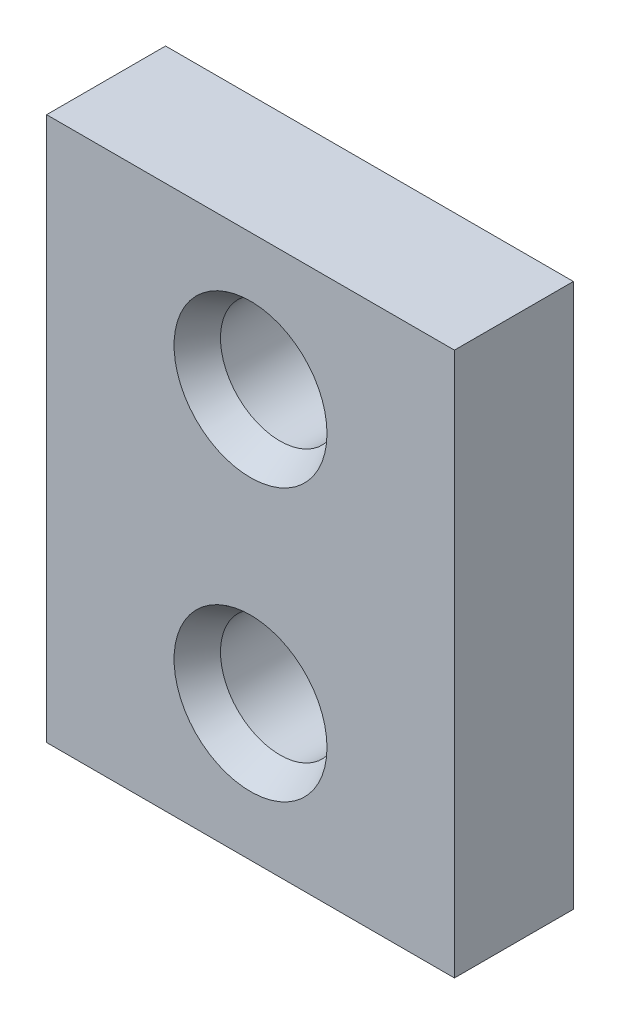
ISO-10303-21;
HEADER;
FILE_DESCRIPTION(('STEP AP214'),'2;1');
FILE_NAME('part.step','',(''),(''),'','','');
FILE_SCHEMA(('AUTOMOTIVE_DESIGN { 1 0 10303 214 1 1 1 1 }'));
ENDSEC;
DATA;
#1=APPLICATION_CONTEXT('core data for automotive mechanical design processes');
#2=APPLICATION_PROTOCOL_DEFINITION('international standard','automotive_design',2000,#1);
#3=PRODUCT_CONTEXT('',#1,'mechanical');
#4=PRODUCT('Part','Part','',(#3));
#5=PRODUCT_RELATED_PRODUCT_CATEGORY('part','',(#4));
#6=PRODUCT_DEFINITION_FORMATION('','',#4);
#7=PRODUCT_DEFINITION_CONTEXT('part definition',#1,'design');
#8=PRODUCT_DEFINITION('design','',#6,#7);
#9=PRODUCT_DEFINITION_SHAPE('','',#8);
#10=(LENGTH_UNIT() NAMED_UNIT(*) SI_UNIT(.MILLI.,.METRE.));
#11=(NAMED_UNIT(*) PLANE_ANGLE_UNIT() SI_UNIT($,.RADIAN.));
#12=(NAMED_UNIT(*) SI_UNIT($,.STERADIAN.) SOLID_ANGLE_UNIT());
#13=UNCERTAINTY_MEASURE_WITH_UNIT(LENGTH_MEASURE(1.E-05),#10,'distance_accuracy_value','');
#14=(GEOMETRIC_REPRESENTATION_CONTEXT(3) GLOBAL_UNCERTAINTY_ASSIGNED_CONTEXT((#13)) GLOBAL_UNIT_ASSIGNED_CONTEXT((#10,
#11,#12)) REPRESENTATION_CONTEXT('',''));
#15=CARTESIAN_POINT('',(0.,0.,0.));
#16=DIRECTION('',(0.,0.,1.));
#17=DIRECTION('',(1.,0.,0.));
#18=AXIS2_PLACEMENT_3D('',#15,#16,#17);
#19=CARTESIAN_POINT('',(12.,-16.,3.5));
#20=DIRECTION('',(-1.,0.,0.));
#21=DIRECTION('',(0.,0.,1.));
#22=AXIS2_PLACEMENT_3D('',#19,#20,#21);
#23=PLANE('',#22);
#24=DIRECTION('',(0.,1.,0.));
#25=VECTOR('',#24,1.);
#26=CARTESIAN_POINT('',(12.,-16.,-3.5));
#27=LINE('',#26,#25);
#28=CARTESIAN_POINT('',(12.,-16.,-3.5));
#29=VERTEX_POINT('',#28);
#30=CARTESIAN_POINT('',(12.,16.,-3.5));
#31=VERTEX_POINT('',#30);
#32=EDGE_CURVE('E99',#29,#31,#27,.T.);
#33=ORIENTED_EDGE('',*,*,#32,.T.);
#34=DIRECTION('',(0.,0.,-1.));
#35=VECTOR('',#34,1.);
#36=CARTESIAN_POINT('',(12.,16.,3.5));
#37=LINE('',#36,#35);
#38=CARTESIAN_POINT('',(12.,16.,3.5));
#39=VERTEX_POINT('',#38);
#40=EDGE_CURVE('E11',#39,#31,#37,.T.);
#41=ORIENTED_EDGE('',*,*,#40,.F.);
#42=DIRECTION('',(0.,1.,0.));
#43=VECTOR('',#42,1.);
#44=CARTESIAN_POINT('',(12.,-16.,3.5));
#45=LINE('',#44,#43);
#46=CARTESIAN_POINT('',(12.,-16.,3.5));
#47=VERTEX_POINT('',#46);
#48=EDGE_CURVE('E86',#47,#39,#45,.T.);
#49=ORIENTED_EDGE('',*,*,#48,.F.);
#50=DIRECTION('',(0.,0.,-1.));
#51=VECTOR('',#50,1.);
#52=CARTESIAN_POINT('',(12.,-16.,3.5));
#53=LINE('',#52,#51);
#54=EDGE_CURVE('E95',#47,#29,#53,.T.);
#55=ORIENTED_EDGE('',*,*,#54,.T.);
#56=EDGE_LOOP('',(#33,#41,#49,#55));
#57=FACE_BOUND('',#56,.T.);
#58=ADVANCED_FACE('F33',(#57),#23,.F.);
#59=CARTESIAN_POINT('',(-12.,16.,3.5));
#60=DIRECTION('',(0.,-1.,0.));
#61=DIRECTION('',(0.,0.,-1.));
#62=AXIS2_PLACEMENT_3D('',#59,#60,#61);
#63=PLANE('',#62);
#64=DIRECTION('',(-1.,0.,0.));
#65=VECTOR('',#64,1.);
#66=CARTESIAN_POINT('',(-12.,16.,-3.5));
#67=LINE('',#66,#65);
#68=CARTESIAN_POINT('',(-12.,16.,-3.5));
#69=VERTEX_POINT('',#68);
#70=EDGE_CURVE('E90',#31,#69,#67,.T.);
#71=ORIENTED_EDGE('',*,*,#70,.T.);
#72=DIRECTION('',(0.,0.,-1.));
#73=VECTOR('',#72,1.);
#74=CARTESIAN_POINT('',(-12.,16.,3.5));
#75=LINE('',#74,#73);
#76=CARTESIAN_POINT('',(-12.,16.,3.5));
#77=VERTEX_POINT('',#76);
#78=EDGE_CURVE('E42',#77,#69,#75,.T.);
#79=ORIENTED_EDGE('',*,*,#78,.F.);
#80=DIRECTION('',(-1.,0.,0.));
#81=VECTOR('',#80,1.);
#82=CARTESIAN_POINT('',(-12.,16.,3.5));
#83=LINE('',#82,#81);
#84=EDGE_CURVE('E81',#39,#77,#83,.T.);
#85=ORIENTED_EDGE('',*,*,#84,.F.);
#86=ORIENTED_EDGE('',*,*,#40,.T.);
#87=EDGE_LOOP('',(#71,#79,#85,#86));
#88=FACE_BOUND('',#87,.T.);
#89=ADVANCED_FACE('F89',(#88),#63,.F.);
#90=CARTESIAN_POINT('',(-12.,-16.,3.5));
#91=DIRECTION('',(1.,0.,0.));
#92=DIRECTION('',(0.,0.,-1.));
#93=AXIS2_PLACEMENT_3D('',#90,#91,#92);
#94=PLANE('',#93);
#95=DIRECTION('',(0.,-1.,0.));
#96=VECTOR('',#95,1.);
#97=CARTESIAN_POINT('',(-12.,-16.,-3.5));
#98=LINE('',#97,#96);
#99=CARTESIAN_POINT('',(-12.,-16.,-3.5));
#100=VERTEX_POINT('',#99);
#101=EDGE_CURVE('E68',#69,#100,#98,.T.);
#102=ORIENTED_EDGE('',*,*,#101,.T.);
#103=DIRECTION('',(0.,0.,-1.));
#104=VECTOR('',#103,1.);
#105=CARTESIAN_POINT('',(-12.,-16.,3.5));
#106=LINE('',#105,#104);
#107=CARTESIAN_POINT('',(-12.,-16.,3.5));
#108=VERTEX_POINT('',#107);
#109=EDGE_CURVE('E91',#108,#100,#106,.T.);
#110=ORIENTED_EDGE('',*,*,#109,.F.);
#111=DIRECTION('',(0.,-1.,0.));
#112=VECTOR('',#111,1.);
#113=CARTESIAN_POINT('',(-12.,-16.,3.5));
#114=LINE('',#113,#112);
#115=EDGE_CURVE('E84',#77,#108,#114,.T.);
#116=ORIENTED_EDGE('',*,*,#115,.F.);
#117=ORIENTED_EDGE('',*,*,#78,.T.);
#118=EDGE_LOOP('',(#102,#110,#116,#117));
#119=FACE_BOUND('',#118,.T.);
#120=ADVANCED_FACE('F93',(#119),#94,.F.);
#121=CARTESIAN_POINT('',(-12.,-16.,3.5));
#122=DIRECTION('',(0.,1.,0.));
#123=DIRECTION('',(0.,0.,1.));
#124=AXIS2_PLACEMENT_3D('',#121,#122,#123);
#125=PLANE('',#124);
#126=DIRECTION('',(1.,0.,0.));
#127=VECTOR('',#126,1.);
#128=CARTESIAN_POINT('',(-12.,-16.,-3.5));
#129=LINE('',#128,#127);
#130=EDGE_CURVE('E74',#100,#29,#129,.T.);
#131=ORIENTED_EDGE('',*,*,#130,.T.);
#132=ORIENTED_EDGE('',*,*,#54,.F.);
#133=DIRECTION('',(1.,0.,0.));
#134=VECTOR('',#133,1.);
#135=CARTESIAN_POINT('',(-12.,-16.,3.5));
#136=LINE('',#135,#134);
#137=EDGE_CURVE('E51',#108,#47,#136,.T.);
#138=ORIENTED_EDGE('',*,*,#137,.F.);
#139=ORIENTED_EDGE('',*,*,#109,.T.);
#140=EDGE_LOOP('',(#131,#132,#138,#139));
#141=FACE_BOUND('',#140,.T.);
#142=ADVANCED_FACE('F131',(#141),#125,.F.);
#143=CARTESIAN_POINT('',(0.,0.,3.5));
#144=DIRECTION('',(0.,0.,-1.));
#145=DIRECTION('',(-1.,0.,0.));
#146=AXIS2_PLACEMENT_3D('',#143,#144,#145);
#147=PLANE('',#146);
#148=CARTESIAN_POINT('',(0.,8.,3.5));
#149=DIRECTION('',(0.,0.,1.));
#150=DIRECTION('',(1.,0.,0.));
#151=AXIS2_PLACEMENT_3D('',#148,#149,#150);
#152=CIRCLE('',#151,4.5);
#153=CARTESIAN_POINT('',(4.5,8.,3.5));
#154=VERTEX_POINT('',#153);
#155=EDGE_CURVE('E122',#154,#154,#152,.T.);
#156=ORIENTED_EDGE('',*,*,#155,.F.);
#157=EDGE_LOOP('',(#156));
#158=FACE_BOUND('',#157,.T.);
#159=CARTESIAN_POINT('',(0.,-8.,3.5));
#160=DIRECTION('',(0.,0.,1.));
#161=DIRECTION('',(1.,0.,0.));
#162=AXIS2_PLACEMENT_3D('',#159,#160,#161);
#163=CIRCLE('',#162,4.5);
#164=CARTESIAN_POINT('',(4.5,-8.,3.5));
#165=VERTEX_POINT('',#164);
#166=EDGE_CURVE('E112',#165,#165,#163,.T.);
#167=ORIENTED_EDGE('',*,*,#166,.F.);
#168=EDGE_LOOP('',(#167));
#169=FACE_BOUND('',#168,.T.);
#170=ORIENTED_EDGE('',*,*,#48,.T.);
#171=ORIENTED_EDGE('',*,*,#84,.T.);
#172=ORIENTED_EDGE('',*,*,#115,.T.);
#173=ORIENTED_EDGE('',*,*,#137,.T.);
#174=EDGE_LOOP('',(#170,#171,#172,#173));
#175=FACE_BOUND('',#174,.T.);
#176=ADVANCED_FACE('F82',(#158,#169,#175),#147,.F.);
#177=CARTESIAN_POINT('',(0.,0.,-3.5));
#178=DIRECTION('',(0.,0.,-1.));
#179=DIRECTION('',(-1.,0.,0.));
#180=AXIS2_PLACEMENT_3D('',#177,#178,#179);
#181=PLANE('',#180);
#182=CARTESIAN_POINT('',(0.,8.,-3.5));
#183=DIRECTION('',(0.,0.,-1.));
#184=DIRECTION('',(-1.,0.,0.));
#185=AXIS2_PLACEMENT_3D('',#182,#183,#184);
#186=CIRCLE('',#185,3.5);
#187=CARTESIAN_POINT('',(-3.5,8.,-3.5));
#188=VERTEX_POINT('',#187);
#189=EDGE_CURVE('E36',#188,#188,#186,.T.);
#190=ORIENTED_EDGE('',*,*,#189,.F.);
#191=EDGE_LOOP('',(#190));
#192=FACE_BOUND('',#191,.T.);
#193=CARTESIAN_POINT('',(0.,-8.,-3.5));
#194=DIRECTION('',(0.,0.,-1.));
#195=DIRECTION('',(-1.,0.,0.));
#196=AXIS2_PLACEMENT_3D('',#193,#194,#195);
#197=CIRCLE('',#196,3.5);
#198=CARTESIAN_POINT('',(-3.5,-8.,-3.5));
#199=VERTEX_POINT('',#198);
#200=EDGE_CURVE('E102',#199,#199,#197,.T.);
#201=ORIENTED_EDGE('',*,*,#200,.F.);
#202=EDGE_LOOP('',(#201));
#203=FACE_BOUND('',#202,.T.);
#204=ORIENTED_EDGE('',*,*,#32,.F.);
#205=ORIENTED_EDGE('',*,*,#130,.F.);
#206=ORIENTED_EDGE('',*,*,#101,.F.);
#207=ORIENTED_EDGE('',*,*,#70,.F.);
#208=EDGE_LOOP('',(#204,#205,#206,#207));
#209=FACE_BOUND('',#208,.T.);
#210=ADVANCED_FACE('F130',(#192,#203,#209),#181,.T.);
#211=CARTESIAN_POINT('',(0.,-8.,3.5));
#212=DIRECTION('',(0.,0.,1.));
#213=DIRECTION('',(1.,0.,0.));
#214=AXIS2_PLACEMENT_3D('',#211,#212,#213);
#215=CYLINDRICAL_SURFACE('',#214,3.5);
#216=ORIENTED_EDGE('',*,*,#200,.T.);
#217=EDGE_LOOP('',(#216));
#218=FACE_BOUND('',#217,.T.);
#219=CARTESIAN_POINT('',(0.,-8.,1.76794919243113));
#220=DIRECTION('',(0.,0.,1.));
#221=DIRECTION('',(1.,0.,0.));
#222=AXIS2_PLACEMENT_3D('',#219,#220,#221);
#223=CIRCLE('',#222,3.5);
#224=CARTESIAN_POINT('',(3.5,-8.,1.76794919243113));
#225=VERTEX_POINT('',#224);
#226=EDGE_CURVE('E108',#225,#225,#223,.T.);
#227=ORIENTED_EDGE('',*,*,#226,.T.);
#228=EDGE_LOOP('',(#227));
#229=FACE_BOUND('',#228,.T.);
#230=ADVANCED_FACE('F138',(#218,#229),#215,.F.);
#231=CARTESIAN_POINT('',(0.,-8.,3.5));
#232=DIRECTION('',(0.,0.,1.));
#233=DIRECTION('',(1.,0.,0.));
#234=AXIS2_PLACEMENT_3D('',#231,#232,#233);
#235=CONICAL_SURFACE('',#234,4.5,0.5235987755983);
#236=ORIENTED_EDGE('',*,*,#226,.F.);
#237=EDGE_LOOP('',(#236));
#238=FACE_BOUND('',#237,.T.);
#239=ORIENTED_EDGE('',*,*,#166,.T.);
#240=EDGE_LOOP('',(#239));
#241=FACE_BOUND('',#240,.T.);
#242=ADVANCED_FACE('F135',(#238,#241),#235,.F.);
#243=CARTESIAN_POINT('',(0.,8.,3.5));
#244=DIRECTION('',(0.,0.,1.));
#245=DIRECTION('',(1.,0.,0.));
#246=AXIS2_PLACEMENT_3D('',#243,#244,#245);
#247=CYLINDRICAL_SURFACE('',#246,3.5);
#248=ORIENTED_EDGE('',*,*,#189,.T.);
#249=EDGE_LOOP('',(#248));
#250=FACE_BOUND('',#249,.T.);
#251=CARTESIAN_POINT('',(0.,8.,1.76794919243113));
#252=DIRECTION('',(0.,0.,1.));
#253=DIRECTION('',(1.,0.,0.));
#254=AXIS2_PLACEMENT_3D('',#251,#252,#253);
#255=CIRCLE('',#254,3.5);
#256=CARTESIAN_POINT('',(3.5,8.,1.76794919243113));
#257=VERTEX_POINT('',#256);
#258=EDGE_CURVE('E119',#257,#257,#255,.T.);
#259=ORIENTED_EDGE('',*,*,#258,.T.);
#260=EDGE_LOOP('',(#259));
#261=FACE_BOUND('',#260,.T.);
#262=ADVANCED_FACE('F137',(#250,#261),#247,.F.);
#263=CARTESIAN_POINT('',(0.,8.,3.5));
#264=DIRECTION('',(0.,0.,1.));
#265=DIRECTION('',(1.,0.,0.));
#266=AXIS2_PLACEMENT_3D('',#263,#264,#265);
#267=CONICAL_SURFACE('',#266,4.5,0.5235987755983);
#268=ORIENTED_EDGE('',*,*,#258,.F.);
#269=EDGE_LOOP('',(#268));
#270=FACE_BOUND('',#269,.T.);
#271=ORIENTED_EDGE('',*,*,#155,.T.);
#272=EDGE_LOOP('',(#271));
#273=FACE_BOUND('',#272,.T.);
#274=ADVANCED_FACE('F126',(#270,#273),#267,.F.);
#275=CLOSED_SHELL('',(#58,#89,#120,#142,#176,#210,#230,#242,#262,#274));
#276=MANIFOLD_SOLID_BREP('B2',#275);
#277=ADVANCED_BREP_SHAPE_REPRESENTATION('',(#18,#276),#14);
#278=SHAPE_DEFINITION_REPRESENTATION(#9,#277);
ENDSEC;
END-ISO-10303-21;
